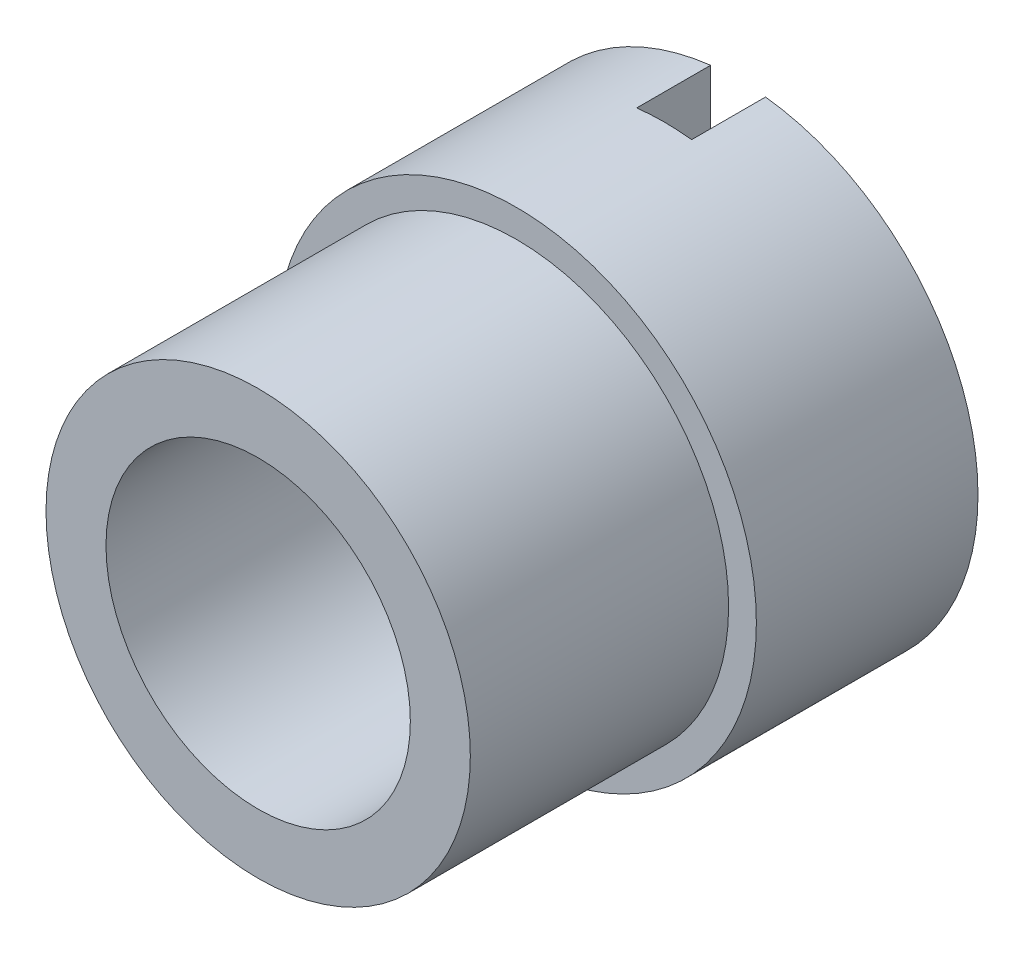
ISO-10303-21;
HEADER;
FILE_DESCRIPTION(('STEP AP214'),'2;1');
FILE_NAME('part.step','',(''),(''),'','','');
FILE_SCHEMA(('AUTOMOTIVE_DESIGN { 1 0 10303 214 1 1 1 1 }'));
ENDSEC;
DATA;
#1=APPLICATION_CONTEXT('core data for automotive mechanical design processes');
#2=APPLICATION_PROTOCOL_DEFINITION('international standard','automotive_design',2000,#1);
#3=PRODUCT_CONTEXT('',#1,'mechanical');
#4=PRODUCT('Part','Part','',(#3));
#5=PRODUCT_RELATED_PRODUCT_CATEGORY('part','',(#4));
#6=PRODUCT_DEFINITION_FORMATION('','',#4);
#7=PRODUCT_DEFINITION_CONTEXT('part definition',#1,'design');
#8=PRODUCT_DEFINITION('design','',#6,#7);
#9=PRODUCT_DEFINITION_SHAPE('','',#8);
#10=(LENGTH_UNIT() NAMED_UNIT(*) SI_UNIT(.MILLI.,.METRE.));
#11=(NAMED_UNIT(*) PLANE_ANGLE_UNIT() SI_UNIT($,.RADIAN.));
#12=(NAMED_UNIT(*) SI_UNIT($,.STERADIAN.) SOLID_ANGLE_UNIT());
#13=UNCERTAINTY_MEASURE_WITH_UNIT(LENGTH_MEASURE(1.E-05),#10,'distance_accuracy_value','');
#14=(GEOMETRIC_REPRESENTATION_CONTEXT(3) GLOBAL_UNCERTAINTY_ASSIGNED_CONTEXT((#13)) GLOBAL_UNIT_ASSIGNED_CONTEXT((#10,
#11,#12)) REPRESENTATION_CONTEXT('',''));
#15=CARTESIAN_POINT('',(0.,0.,0.));
#16=DIRECTION('',(0.,0.,1.));
#17=DIRECTION('',(1.,0.,0.));
#18=AXIS2_PLACEMENT_3D('',#15,#16,#17);
#19=CARTESIAN_POINT('',(0.,0.,-4.7625));
#20=DIRECTION('',(0.,0.,1.));
#21=DIRECTION('',(1.,0.,0.));
#22=AXIS2_PLACEMENT_3D('',#19,#20,#21);
#23=PLANE('',#22);
#24=CARTESIAN_POINT('',(0.,0.,-4.7625));
#25=DIRECTION('',(0.,0.,1.));
#26=DIRECTION('',(1.,0.,0.));
#27=AXIS2_PLACEMENT_3D('',#24,#25,#26);
#28=CIRCLE('',#27,10.3124);
#29=CARTESIAN_POINT('',(1.1811,-10.2445398408128,-4.7625));
#30=VERTEX_POINT('',#29);
#31=CARTESIAN_POINT('',(1.1811,10.2445398408128,-4.7625));
#32=VERTEX_POINT('',#31);
#33=EDGE_CURVE('E133',#30,#32,#28,.T.);
#34=ORIENTED_EDGE('',*,*,#33,.F.);
#35=DIRECTION('',(0.,1.,0.));
#36=VECTOR('',#35,1.);
#37=CARTESIAN_POINT('',(1.1811,-10.3124,-4.7625));
#38=LINE('',#37,#36);
#39=CARTESIAN_POINT('',(1.1811,-6.43297311046766,-4.7625));
#40=VERTEX_POINT('',#39);
#41=EDGE_CURVE('E198',#30,#40,#38,.T.);
#42=ORIENTED_EDGE('',*,*,#41,.T.);
#43=CARTESIAN_POINT('',(0.,0.,-4.7625));
#44=DIRECTION('',(0.,0.,1.));
#45=DIRECTION('',(1.,0.,0.));
#46=AXIS2_PLACEMENT_3D('',#43,#44,#45);
#47=CIRCLE('',#46,6.5405);
#48=CARTESIAN_POINT('',(1.1811,6.43297311046766,-4.7625));
#49=VERTEX_POINT('',#48);
#50=EDGE_CURVE('E166',#40,#49,#47,.T.);
#51=ORIENTED_EDGE('',*,*,#50,.T.);
#52=EDGE_CURVE('E195',#49,#32,#38,.T.);
#53=ORIENTED_EDGE('',*,*,#52,.T.);
#54=EDGE_LOOP('',(#34,#42,#51,#53));
#55=FACE_BOUND('',#54,.T.);
#56=ADVANCED_FACE('F43',(#55),#23,.F.);
#57=CARTESIAN_POINT('',(0.,0.,4.7625));
#58=DIRECTION('',(0.,0.,1.));
#59=DIRECTION('',(1.,0.,0.));
#60=AXIS2_PLACEMENT_3D('',#57,#58,#59);
#61=PLANE('',#60);
#62=CARTESIAN_POINT('',(0.,0.,4.7625));
#63=DIRECTION('',(0.,0.,1.));
#64=DIRECTION('',(1.,0.,0.));
#65=AXIS2_PLACEMENT_3D('',#62,#63,#64);
#66=CIRCLE('',#65,9.1186);
#67=CARTESIAN_POINT('',(9.1186,0.,4.7625));
#68=VERTEX_POINT('',#67);
#69=EDGE_CURVE('E138',#68,#68,#66,.T.);
#70=ORIENTED_EDGE('',*,*,#69,.F.);
#71=EDGE_LOOP('',(#70));
#72=FACE_BOUND('',#71,.T.);
#73=CARTESIAN_POINT('',(0.,0.,4.7625));
#74=DIRECTION('',(0.,0.,1.));
#75=DIRECTION('',(1.,0.,0.));
#76=AXIS2_PLACEMENT_3D('',#73,#74,#75);
#77=CIRCLE('',#76,10.3124);
#78=CARTESIAN_POINT('',(10.3124,0.,4.7625));
#79=VERTEX_POINT('',#78);
#80=EDGE_CURVE('E132',#79,#79,#77,.T.);
#81=ORIENTED_EDGE('',*,*,#80,.T.);
#82=EDGE_LOOP('',(#81));
#83=FACE_BOUND('',#82,.T.);
#84=ADVANCED_FACE('F233',(#72,#83),#61,.T.);
#85=CARTESIAN_POINT('',(-1.1811,10.2445398408128,-4.7625));
#86=VERTEX_POINT('',#85);
#87=CARTESIAN_POINT('',(-1.1811,-10.2445398408128,-4.7625));
#88=VERTEX_POINT('',#87);
#89=EDGE_CURVE('E123',#86,#88,#28,.T.);
#90=ORIENTED_EDGE('',*,*,#89,.F.);
#91=DIRECTION('',(0.,1.,0.));
#92=VECTOR('',#91,1.);
#93=CARTESIAN_POINT('',(-1.1811,-10.3124,-4.7625));
#94=LINE('',#93,#92);
#95=CARTESIAN_POINT('',(-1.1811,6.43297311046766,-4.7625));
#96=VERTEX_POINT('',#95);
#97=EDGE_CURVE('E127',#96,#86,#94,.T.);
#98=ORIENTED_EDGE('',*,*,#97,.F.);
#99=CARTESIAN_POINT('',(-1.1811,-6.43297311046766,-4.7625));
#100=VERTEX_POINT('',#99);
#101=EDGE_CURVE('E125',#96,#100,#47,.T.);
#102=ORIENTED_EDGE('',*,*,#101,.T.);
#103=EDGE_CURVE('E67',#88,#100,#94,.T.);
#104=ORIENTED_EDGE('',*,*,#103,.F.);
#105=EDGE_LOOP('',(#90,#98,#102,#104));
#106=FACE_BOUND('',#105,.T.);
#107=ADVANCED_FACE('F121',(#106),#23,.F.);
#108=CARTESIAN_POINT('',(0.,0.,4.7625));
#109=DIRECTION('',(0.,0.,-1.));
#110=DIRECTION('',(-1.,0.,0.));
#111=AXIS2_PLACEMENT_3D('',#108,#109,#110);
#112=CYLINDRICAL_SURFACE('',#111,10.3124);
#113=ORIENTED_EDGE('',*,*,#80,.F.);
#114=EDGE_LOOP('',(#113));
#115=FACE_BOUND('',#114,.T.);
#116=ORIENTED_EDGE('',*,*,#33,.T.);
#117=DIRECTION('',(0.,0.,-1.));
#118=VECTOR('',#117,1.);
#119=CARTESIAN_POINT('',(1.1811,10.2445398408128,4.7625));
#120=LINE('',#119,#118);
#121=CARTESIAN_POINT('',(1.1811,10.2445398408128,-1.5875));
#122=VERTEX_POINT('',#121);
#123=EDGE_CURVE('E185',#32,#122,#120,.F.);
#124=ORIENTED_EDGE('',*,*,#123,.T.);
#125=CARTESIAN_POINT('',(0.,0.,-1.5875));
#126=DIRECTION('',(0.,0.,1.));
#127=DIRECTION('',(1.,0.,0.));
#128=AXIS2_PLACEMENT_3D('',#125,#126,#127);
#129=CIRCLE('',#128,10.3124);
#130=CARTESIAN_POINT('',(-1.1811,10.2445398408128,-1.5875));
#131=VERTEX_POINT('',#130);
#132=EDGE_CURVE('E189',#122,#131,#129,.T.);
#133=ORIENTED_EDGE('',*,*,#132,.T.);
#134=DIRECTION('',(0.,0.,-1.));
#135=VECTOR('',#134,1.);
#136=CARTESIAN_POINT('',(-1.1811,10.2445398408128,4.7625));
#137=LINE('',#136,#135);
#138=EDGE_CURVE('E115',#131,#86,#137,.T.);
#139=ORIENTED_EDGE('',*,*,#138,.T.);
#140=ORIENTED_EDGE('',*,*,#89,.T.);
#141=DIRECTION('',(0.,0.,-1.));
#142=VECTOR('',#141,1.);
#143=CARTESIAN_POINT('',(-1.1811,-10.2445398408128,4.7625));
#144=LINE('',#143,#142);
#145=CARTESIAN_POINT('',(-1.1811,-10.2445398408128,-1.5875));
#146=VERTEX_POINT('',#145);
#147=EDGE_CURVE('E108',#88,#146,#144,.F.);
#148=ORIENTED_EDGE('',*,*,#147,.T.);
#149=CARTESIAN_POINT('',(1.1811,-10.2445398408128,-1.5875));
#150=VERTEX_POINT('',#149);
#151=EDGE_CURVE('E192',#146,#150,#129,.T.);
#152=ORIENTED_EDGE('',*,*,#151,.T.);
#153=DIRECTION('',(0.,0.,-1.));
#154=VECTOR('',#153,1.);
#155=CARTESIAN_POINT('',(1.1811,-10.2445398408128,4.7625));
#156=LINE('',#155,#154);
#157=EDGE_CURVE('E181',#150,#30,#156,.T.);
#158=ORIENTED_EDGE('',*,*,#157,.T.);
#159=EDGE_LOOP('',(#116,#124,#133,#139,#140,#148,#152,#158));
#160=FACE_BOUND('',#159,.T.);
#161=ADVANCED_FACE('F45',(#115,#160),#112,.T.);
#162=CARTESIAN_POINT('',(0.,0.,4.7625));
#163=DIRECTION('',(0.,0.,-1.));
#164=DIRECTION('',(-1.,0.,0.));
#165=AXIS2_PLACEMENT_3D('',#162,#163,#164);
#166=CYLINDRICAL_SURFACE('',#165,6.5405);
#167=DIRECTION('',(0.,0.,-1.));
#168=VECTOR('',#167,1.);
#169=CARTESIAN_POINT('',(1.1811,6.43297311046766,4.7625));
#170=LINE('',#169,#168);
#171=CARTESIAN_POINT('',(1.1811,6.43297311046766,-1.5875));
#172=VERTEX_POINT('',#171);
#173=EDGE_CURVE('E11',#49,#172,#170,.F.);
#174=ORIENTED_EDGE('',*,*,#173,.F.);
#175=ORIENTED_EDGE('',*,*,#50,.F.);
#176=DIRECTION('',(0.,0.,-1.));
#177=VECTOR('',#176,1.);
#178=CARTESIAN_POINT('',(1.1811,-6.43297311046766,4.7625));
#179=LINE('',#178,#177);
#180=CARTESIAN_POINT('',(1.1811,-6.43297311046766,-1.5875));
#181=VERTEX_POINT('',#180);
#182=EDGE_CURVE('E148',#181,#40,#179,.T.);
#183=ORIENTED_EDGE('',*,*,#182,.F.);
#184=CARTESIAN_POINT('',(0.,0.,-1.5875));
#185=DIRECTION('',(0.,0.,1.));
#186=DIRECTION('',(1.,0.,0.));
#187=AXIS2_PLACEMENT_3D('',#184,#185,#186);
#188=CIRCLE('',#187,6.5405);
#189=CARTESIAN_POINT('',(-1.1811,-6.43297311046766,-1.5875));
#190=VERTEX_POINT('',#189);
#191=EDGE_CURVE('E145',#190,#181,#188,.T.);
#192=ORIENTED_EDGE('',*,*,#191,.F.);
#193=DIRECTION('',(0.,0.,-1.));
#194=VECTOR('',#193,1.);
#195=CARTESIAN_POINT('',(-1.1811,-6.43297311046766,4.7625));
#196=LINE('',#195,#194);
#197=EDGE_CURVE('E142',#100,#190,#196,.F.);
#198=ORIENTED_EDGE('',*,*,#197,.F.);
#199=ORIENTED_EDGE('',*,*,#101,.F.);
#200=DIRECTION('',(0.,0.,-1.));
#201=VECTOR('',#200,1.);
#202=CARTESIAN_POINT('',(-1.1811,6.43297311046766,4.7625));
#203=LINE('',#202,#201);
#204=CARTESIAN_POINT('',(-1.1811,6.43297311046766,-1.5875));
#205=VERTEX_POINT('',#204);
#206=EDGE_CURVE('E150',#205,#96,#203,.T.);
#207=ORIENTED_EDGE('',*,*,#206,.F.);
#208=EDGE_CURVE('E52',#172,#205,#188,.T.);
#209=ORIENTED_EDGE('',*,*,#208,.F.);
#210=EDGE_LOOP('',(#174,#175,#183,#192,#198,#199,#207,#209));
#211=FACE_BOUND('',#210,.T.);
#212=CARTESIAN_POINT('',(0.,0.,15.8623));
#213=DIRECTION('',(0.,0.,1.));
#214=DIRECTION('',(1.,0.,0.));
#215=AXIS2_PLACEMENT_3D('',#212,#213,#214);
#216=CIRCLE('',#215,6.5405);
#217=CARTESIAN_POINT('',(6.5405,0.,15.8623));
#218=VERTEX_POINT('',#217);
#219=EDGE_CURVE('E177',#218,#218,#216,.T.);
#220=ORIENTED_EDGE('',*,*,#219,.T.);
#221=EDGE_LOOP('',(#220));
#222=FACE_BOUND('',#221,.T.);
#223=ADVANCED_FACE('F162',(#211,#222),#166,.F.);
#224=CARTESIAN_POINT('',(0.,0.,15.8623));
#225=DIRECTION('',(0.,0.,1.));
#226=DIRECTION('',(1.,0.,0.));
#227=AXIS2_PLACEMENT_3D('',#224,#225,#226);
#228=PLANE('',#227);
#229=CARTESIAN_POINT('',(0.,0.,15.8623));
#230=DIRECTION('',(0.,0.,1.));
#231=DIRECTION('',(1.,0.,0.));
#232=AXIS2_PLACEMENT_3D('',#229,#230,#231);
#233=CIRCLE('',#232,9.1186);
#234=CARTESIAN_POINT('',(9.1186,0.,15.8623));
#235=VERTEX_POINT('',#234);
#236=EDGE_CURVE('E169',#235,#235,#233,.T.);
#237=ORIENTED_EDGE('',*,*,#236,.T.);
#238=EDGE_LOOP('',(#237));
#239=FACE_BOUND('',#238,.T.);
#240=ORIENTED_EDGE('',*,*,#219,.F.);
#241=EDGE_LOOP('',(#240));
#242=FACE_BOUND('',#241,.T.);
#243=ADVANCED_FACE('F247',(#239,#242),#228,.T.);
#244=CARTESIAN_POINT('',(0.,0.,15.8623));
#245=DIRECTION('',(0.,0.,-1.));
#246=DIRECTION('',(-1.,0.,0.));
#247=AXIS2_PLACEMENT_3D('',#244,#245,#246);
#248=CYLINDRICAL_SURFACE('',#247,9.1186);
#249=ORIENTED_EDGE('',*,*,#236,.F.);
#250=EDGE_LOOP('',(#249));
#251=FACE_BOUND('',#250,.T.);
#252=ORIENTED_EDGE('',*,*,#69,.T.);
#253=EDGE_LOOP('',(#252));
#254=FACE_BOUND('',#253,.T.);
#255=ADVANCED_FACE('F254',(#251,#254),#248,.T.);
#256=CARTESIAN_POINT('',(-1.1811,-10.3124,-1.5875));
#257=DIRECTION('',(-1.,0.,0.));
#258=DIRECTION('',(0.,0.,1.));
#259=AXIS2_PLACEMENT_3D('',#256,#257,#258);
#260=PLANE('',#259);
#261=ORIENTED_EDGE('',*,*,#103,.T.);
#262=ORIENTED_EDGE('',*,*,#197,.T.);
#263=DIRECTION('',(0.,1.,0.));
#264=VECTOR('',#263,1.);
#265=CARTESIAN_POINT('',(-1.1811,-10.3124,-1.5875));
#266=LINE('',#265,#264);
#267=EDGE_CURVE('E111',#146,#190,#266,.T.);
#268=ORIENTED_EDGE('',*,*,#267,.F.);
#269=ORIENTED_EDGE('',*,*,#147,.F.);
#270=EDGE_LOOP('',(#261,#262,#268,#269));
#271=FACE_BOUND('',#270,.T.);
#272=ADVANCED_FACE('F109',(#271),#260,.F.);
#273=CARTESIAN_POINT('',(-1.1811,-10.3124,-1.5875));
#274=DIRECTION('',(0.,0.,1.));
#275=DIRECTION('',(1.,0.,0.));
#276=AXIS2_PLACEMENT_3D('',#273,#274,#275);
#277=PLANE('',#276);
#278=ORIENTED_EDGE('',*,*,#267,.T.);
#279=ORIENTED_EDGE('',*,*,#191,.T.);
#280=DIRECTION('',(0.,1.,0.));
#281=VECTOR('',#280,1.);
#282=CARTESIAN_POINT('',(1.1811,-10.3124,-1.5875));
#283=LINE('',#282,#281);
#284=EDGE_CURVE('E116',#150,#181,#283,.T.);
#285=ORIENTED_EDGE('',*,*,#284,.F.);
#286=ORIENTED_EDGE('',*,*,#151,.F.);
#287=EDGE_LOOP('',(#278,#279,#285,#286));
#288=FACE_BOUND('',#287,.T.);
#289=ADVANCED_FACE('F209',(#288),#277,.F.);
#290=CARTESIAN_POINT('',(1.1811,-10.3124,-1.5875));
#291=DIRECTION('',(1.,0.,0.));
#292=DIRECTION('',(0.,0.,-1.));
#293=AXIS2_PLACEMENT_3D('',#290,#291,#292);
#294=PLANE('',#293);
#295=ORIENTED_EDGE('',*,*,#284,.T.);
#296=ORIENTED_EDGE('',*,*,#182,.T.);
#297=ORIENTED_EDGE('',*,*,#41,.F.);
#298=ORIENTED_EDGE('',*,*,#157,.F.);
#299=EDGE_LOOP('',(#295,#296,#297,#298));
#300=FACE_BOUND('',#299,.T.);
#301=ADVANCED_FACE('F215',(#300),#294,.F.);
#302=ORIENTED_EDGE('',*,*,#52,.F.);
#303=ORIENTED_EDGE('',*,*,#173,.T.);
#304=EDGE_CURVE('E159',#172,#122,#283,.T.);
#305=ORIENTED_EDGE('',*,*,#304,.T.);
#306=ORIENTED_EDGE('',*,*,#123,.F.);
#307=EDGE_LOOP('',(#302,#303,#305,#306));
#308=FACE_BOUND('',#307,.T.);
#309=ADVANCED_FACE('F221',(#308),#294,.F.);
#310=ORIENTED_EDGE('',*,*,#304,.F.);
#311=ORIENTED_EDGE('',*,*,#208,.T.);
#312=EDGE_CURVE('E59',#205,#131,#266,.T.);
#313=ORIENTED_EDGE('',*,*,#312,.T.);
#314=ORIENTED_EDGE('',*,*,#132,.F.);
#315=EDGE_LOOP('',(#310,#311,#313,#314));
#316=FACE_BOUND('',#315,.T.);
#317=ADVANCED_FACE('F157',(#316),#277,.F.);
#318=ORIENTED_EDGE('',*,*,#312,.F.);
#319=ORIENTED_EDGE('',*,*,#206,.T.);
#320=ORIENTED_EDGE('',*,*,#97,.T.);
#321=ORIENTED_EDGE('',*,*,#138,.F.);
#322=EDGE_LOOP('',(#318,#319,#320,#321));
#323=FACE_BOUND('',#322,.T.);
#324=ADVANCED_FACE('F228',(#323),#260,.F.);
#325=CLOSED_SHELL('',(#56,#84,#107,#161,#223,#243,#255,#272,#289,#301,#309,#317,#324));
#326=MANIFOLD_SOLID_BREP('B2',#325);
#327=ADVANCED_BREP_SHAPE_REPRESENTATION('',(#18,#326),#14);
#328=SHAPE_DEFINITION_REPRESENTATION(#9,#327);
ENDSEC;
END-ISO-10303-21;
